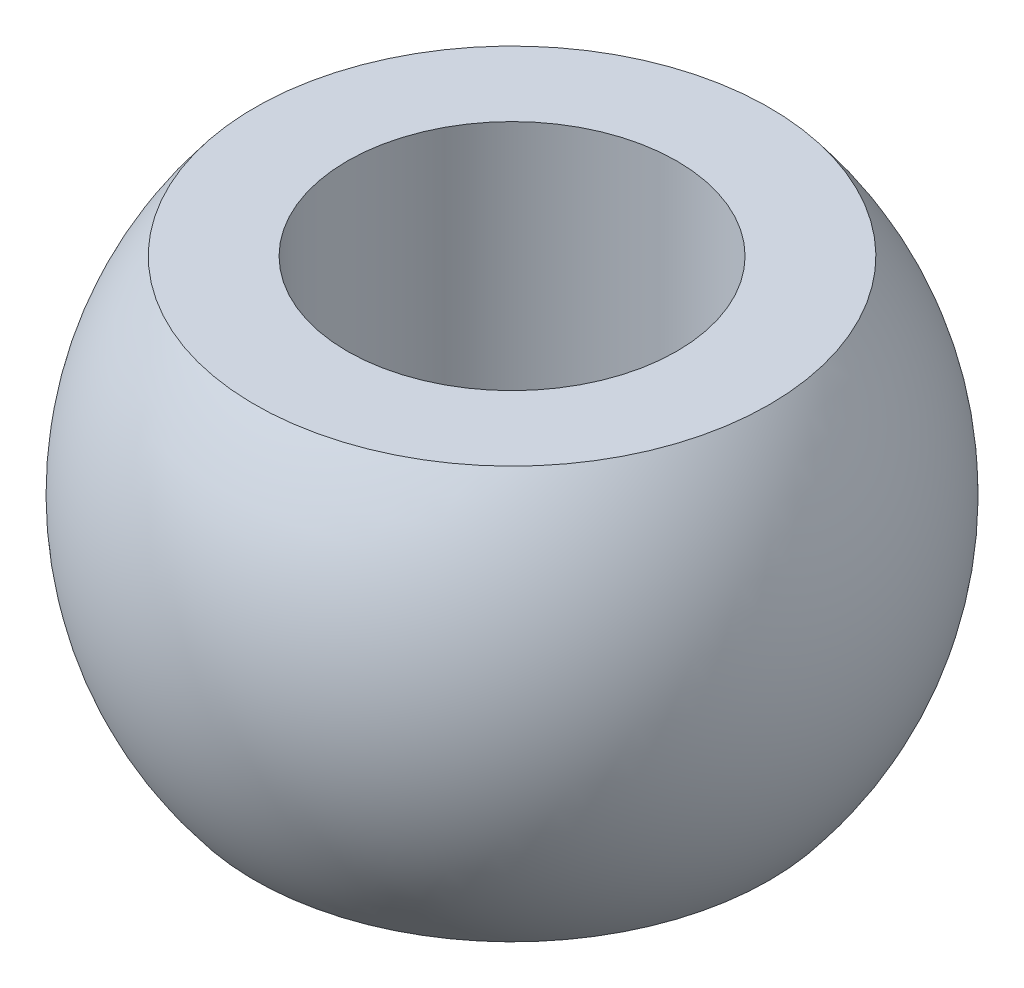
ISO-10303-21;
HEADER;
FILE_DESCRIPTION(('STEP AP214'),'2;1');
FILE_NAME('part.step','',(''),(''),'','','');
FILE_SCHEMA(('AUTOMOTIVE_DESIGN { 1 0 10303 214 1 1 1 1 }'));
ENDSEC;
DATA;
#1=APPLICATION_CONTEXT('core data for automotive mechanical design processes');
#2=APPLICATION_PROTOCOL_DEFINITION('international standard','automotive_design',2000,#1);
#3=PRODUCT_CONTEXT('',#1,'mechanical');
#4=PRODUCT('Part','Part','',(#3));
#5=PRODUCT_RELATED_PRODUCT_CATEGORY('part','',(#4));
#6=PRODUCT_DEFINITION_FORMATION('','',#4);
#7=PRODUCT_DEFINITION_CONTEXT('part definition',#1,'design');
#8=PRODUCT_DEFINITION('design','',#6,#7);
#9=PRODUCT_DEFINITION_SHAPE('','',#8);
#10=(LENGTH_UNIT() NAMED_UNIT(*) SI_UNIT(.MILLI.,.METRE.));
#11=(NAMED_UNIT(*) PLANE_ANGLE_UNIT() SI_UNIT($,.RADIAN.));
#12=(NAMED_UNIT(*) SI_UNIT($,.STERADIAN.) SOLID_ANGLE_UNIT());
#13=UNCERTAINTY_MEASURE_WITH_UNIT(LENGTH_MEASURE(1.E-05),#10,'distance_accuracy_value','');
#14=(GEOMETRIC_REPRESENTATION_CONTEXT(3) GLOBAL_UNCERTAINTY_ASSIGNED_CONTEXT((#13)) GLOBAL_UNIT_ASSIGNED_CONTEXT((#10,
#11,#12)) REPRESENTATION_CONTEXT('',''));
#15=CARTESIAN_POINT('',(0.,0.,0.));
#16=DIRECTION('',(0.,0.,1.));
#17=DIRECTION('',(1.,0.,0.));
#18=AXIS2_PLACEMENT_3D('',#15,#16,#17);
#19=CARTESIAN_POINT('',(0.,0.,0.));
#20=DIRECTION('',(0.,1.,0.));
#21=DIRECTION('',(1.,0.,0.));
#22=AXIS2_PLACEMENT_3D('',#19,#20,#21);
#23=SPHERICAL_SURFACE('',#22,8.);
#24=CARTESIAN_POINT('',(0.,5.,0.));
#25=DIRECTION('',(0.,-1.,0.));
#26=DIRECTION('',(0.,0.,-1.));
#27=AXIS2_PLACEMENT_3D('',#24,#25,#26);
#28=CIRCLE('',#27,6.2449979983984);
#29=CARTESIAN_POINT('',(6.2449979983984,5.,0.));
#30=VERTEX_POINT('',#29);
#31=EDGE_CURVE('E11',#30,#30,#28,.F.);
#32=CARTESIAN_POINT('',(0.,-5.,0.));
#33=DIRECTION('',(0.,1.,0.));
#34=DIRECTION('',(0.,0.,1.));
#35=AXIS2_PLACEMENT_3D('',#32,#33,#34);
#36=CIRCLE('',#35,6.2449979983984);
#37=CARTESIAN_POINT('',(6.2449979983984,-5.,0.));
#38=VERTEX_POINT('',#37);
#39=EDGE_CURVE('E45',#38,#38,#36,.F.);
#40=CARTESIAN_POINT('',(6.2449979983984,5.,0.));
#41=CARTESIAN_POINT('',(6.31532542239523,4.91216350208699,0.));
#42=CARTESIAN_POINT('',(6.38379727042982,4.82284149647974,0.));
#43=CARTESIAN_POINT('',(6.51691329407893,4.64138942477172,0.));
#44=CARTESIAN_POINT('',(6.58155746969343,4.54925935867094,0.));
#45=CARTESIAN_POINT('',(6.70690162800672,4.36235412087081,0.));
#46=CARTESIAN_POINT('',(6.76760161070551,4.26757894917145,0.));
#47=CARTESIAN_POINT('',(6.8849497100288,4.07555250338974,0.));
#48=CARTESIAN_POINT('',(6.94159782665332,3.97830122930739,0.));
#49=CARTESIAN_POINT('',(7.0507412446322,3.78149563106059,0.));
#50=CARTESIAN_POINT('',(7.10323654598657,3.68194130689616,0.));
#51=CARTESIAN_POINT('',(7.20398090822055,3.48070685687896,0.));
#52=CARTESIAN_POINT('',(7.25222996910015,3.37902673102621,0.));
#53=CARTESIAN_POINT('',(7.34439594927461,3.17372168464108,0.));
#54=CARTESIAN_POINT('',(7.38831286856946,3.0700967641087,0.));
#55=CARTESIAN_POINT('',(7.47173638601826,2.86108660442972,0.));
#56=CARTESIAN_POINT('',(7.51124298417222,2.75570136528313,0.));
#57=CARTESIAN_POINT('',(7.58577552857971,2.54335817633609,0.));
#58=CARTESIAN_POINT('',(7.62080147483325,2.43640022653565,0.));
#59=CARTESIAN_POINT('',(7.68631036187851,2.22110202449965,0.));
#60=CARTESIAN_POINT('',(7.71679330267022,2.11276177226408,0.));
#61=CARTESIAN_POINT('',(7.77316191257441,1.89489183423884,0.));
#62=CARTESIAN_POINT('',(7.79904758168689,1.78536214844915,0.));
#63=CARTESIAN_POINT('',(7.84617556619433,1.56530832967935,0.));
#64=CARTESIAN_POINT('',(7.86741788158929,1.45478419669923,0.));
#65=CARTESIAN_POINT('',(7.90522134277692,1.2329382402322,0.));
#66=CARTESIAN_POINT('',(7.9217824885696,1.12161641674528,0.));
#67=CARTESIAN_POINT('',(7.9501941281583,0.898373256011238,0.));
#68=CARTESIAN_POINT('',(7.96204462195432,0.786451918764102,0.));
#69=CARTESIAN_POINT('',(7.98101386112632,0.562208974518694,0.));
#70=CARTESIAN_POINT('',(7.9881326065023,0.44988736752042,0.));
#71=CARTESIAN_POINT('',(7.99762567593914,0.225043840348098,0.));
#72=CARTESIAN_POINT('',(8.,0.112521920174049,0.));
#73=CARTESIAN_POINT('',(8.,-0.112521920174049,0.));
#74=CARTESIAN_POINT('',(7.99762567593914,-0.225043840348098,0.));
#75=CARTESIAN_POINT('',(7.9881326065023,-0.44988736752042,0.));
#76=CARTESIAN_POINT('',(7.98101386112632,-0.562208974518694,0.));
#77=CARTESIAN_POINT('',(7.96204462195432,-0.786451918764102,0.));
#78=CARTESIAN_POINT('',(7.9501941281583,-0.898373256011238,0.));
#79=CARTESIAN_POINT('',(7.9217824885696,-1.12161641674528,0.));
#80=CARTESIAN_POINT('',(7.90522134277692,-1.2329382402322,0.));
#81=CARTESIAN_POINT('',(7.86741788158929,-1.45478419669923,0.));
#82=CARTESIAN_POINT('',(7.84617556619433,-1.56530832967935,0.));
#83=CARTESIAN_POINT('',(7.79904758168689,-1.78536214844915,0.));
#84=CARTESIAN_POINT('',(7.77316191257441,-1.89489183423884,0.));
#85=CARTESIAN_POINT('',(7.71679330267022,-2.11276177226408,0.));
#86=CARTESIAN_POINT('',(7.68631036187851,-2.22110202449965,0.));
#87=CARTESIAN_POINT('',(7.62080147483325,-2.43640022653565,0.));
#88=CARTESIAN_POINT('',(7.58577552857971,-2.54335817633609,0.));
#89=CARTESIAN_POINT('',(7.51124298417222,-2.75570136528313,0.));
#90=CARTESIAN_POINT('',(7.47173638601827,-2.86108660442972,0.));
#91=CARTESIAN_POINT('',(7.38831286856946,-3.0700967641087,0.));
#92=CARTESIAN_POINT('',(7.34439594927461,-3.17372168464108,0.));
#93=CARTESIAN_POINT('',(7.25222996910015,-3.37902673102621,0.));
#94=CARTESIAN_POINT('',(7.20398090822055,-3.48070685687897,0.));
#95=CARTESIAN_POINT('',(7.10323654598657,-3.68194130689616,0.));
#96=CARTESIAN_POINT('',(7.0507412446322,-3.78149563106059,0.));
#97=CARTESIAN_POINT('',(6.94159782665332,-3.97830122930739,0.));
#98=CARTESIAN_POINT('',(6.8849497100288,-4.07555250338974,0.));
#99=CARTESIAN_POINT('',(6.76760161070551,-4.26757894917145,0.));
#100=CARTESIAN_POINT('',(6.70690162800672,-4.36235412087081,0.));
#101=CARTESIAN_POINT('',(6.58155746969343,-4.54925935867094,0.));
#102=CARTESIAN_POINT('',(6.51691329407893,-4.64138942477172,0.));
#103=CARTESIAN_POINT('',(6.38379727042982,-4.82284149647975,0.));
#104=CARTESIAN_POINT('',(6.31532542239523,-4.91216350208699,0.));
#105=CARTESIAN_POINT('',(6.2449979983984,-5.,0.));
#106=B_SPLINE_CURVE_WITH_KNOTS('',3,(#40,#41,#42,#43,#44,#45,#46,#47,#48,#49,#50,#51,#52,#53,
#54,#55,#56,#57,#58,#59,#60,#61,#62,#63,#64,#65,#66,#67,#68,#69,#70,#71,#72,#73,#74,#75,#76,#77,
#78,#79,#80,#81,#82,#83,#84,#85,#86,#87,#88,#89,#90,#91,#92,#93,#94,#95,#96,#97,#98,#99,#100,
#101,#102,#103,#104,#105),.UNSPECIFIED.,.F.,.F.,(4,2,2,2,2,2,2,2,2,2,2,2,2,2,2,2,2,2,2,2,2,2,2,
2,2,2,2,2,2,2,2,2,4),(0.,0.33754072416298,0.67508144832596,1.01262217248894,1.35016289665192,
1.6877036208149,2.02524434497788,2.36278506914086,2.70032579330384,3.03786651746681,
3.37540724162979,3.71294796579277,4.05048868995575,4.38802941411873,4.72557013828171,
5.06311086244469,5.40065158660767,5.73819231077065,6.07573303493363,6.41327375909661,
6.75081448325959,7.08835520742257,7.42589593158555,7.76343665574853,8.10097737991151,
8.43851810407449,8.77605882823747,9.11359955240045,9.45114027656343,9.7886810007264,
10.1262217248894,10.4637624490524,10.8013031732153),.UNSPECIFIED.);
#107=EDGE_CURVE('BSEAM39',#30,#38,#106,.T.);
#108=ORIENTED_EDGE('',*,*,#31,.F.);
#109=ORIENTED_EDGE('',*,*,#39,.F.);
#110=ORIENTED_EDGE('',*,*,#107,.T.);
#111=ORIENTED_EDGE('',*,*,#107,.F.);
#112=EDGE_LOOP('',(#108,#110,#109,#111));
#113=FACE_BOUND('',#112,.T.);
#114=ADVANCED_FACE('F39',(#113),#23,.T.);
#115=CARTESIAN_POINT('',(-11.8354956902816,-5.,8.));
#116=DIRECTION('',(0.,1.,0.));
#117=DIRECTION('',(0.,0.,1.));
#118=AXIS2_PLACEMENT_3D('',#115,#116,#117);
#119=PLANE('',#118);
#120=CARTESIAN_POINT('',(0.,-5.,0.));
#121=DIRECTION('',(0.,1.,0.));
#122=DIRECTION('',(0.,0.,1.));
#123=AXIS2_PLACEMENT_3D('',#120,#121,#122);
#124=CIRCLE('',#123,4.);
#125=CARTESIAN_POINT('',(0.,-5.,4.));
#126=VERTEX_POINT('',#125);
#127=EDGE_CURVE('E49',#126,#126,#124,.F.);
#128=ORIENTED_EDGE('',*,*,#127,.F.);
#129=EDGE_LOOP('',(#128));
#130=FACE_BOUND('',#129,.T.);
#131=ORIENTED_EDGE('',*,*,#39,.T.);
#132=EDGE_LOOP('',(#131));
#133=FACE_BOUND('',#132,.T.);
#134=ADVANCED_FACE('F64',(#130,#133),#119,.F.);
#135=CARTESIAN_POINT('',(-11.8354956902816,5.,8.));
#136=DIRECTION('',(0.,-1.,0.));
#137=DIRECTION('',(0.,0.,-1.));
#138=AXIS2_PLACEMENT_3D('',#135,#136,#137);
#139=PLANE('',#138);
#140=CARTESIAN_POINT('',(0.,5.,0.));
#141=DIRECTION('',(0.,1.,0.));
#142=DIRECTION('',(0.,0.,1.));
#143=AXIS2_PLACEMENT_3D('',#140,#141,#142);
#144=CIRCLE('',#143,4.);
#145=CARTESIAN_POINT('',(0.,5.,4.));
#146=VERTEX_POINT('',#145);
#147=EDGE_CURVE('E53',#146,#146,#144,.T.);
#148=ORIENTED_EDGE('',*,*,#147,.F.);
#149=EDGE_LOOP('',(#148));
#150=FACE_BOUND('',#149,.T.);
#151=ORIENTED_EDGE('',*,*,#31,.T.);
#152=EDGE_LOOP('',(#151));
#153=FACE_BOUND('',#152,.T.);
#154=ADVANCED_FACE('F62',(#150,#153),#139,.F.);
#155=CARTESIAN_POINT('',(0.,-5.001,0.));
#156=DIRECTION('',(0.,1.,0.));
#157=DIRECTION('',(0.,0.,1.));
#158=AXIS2_PLACEMENT_3D('',#155,#156,#157);
#159=CYLINDRICAL_SURFACE('',#158,4.);
#160=ORIENTED_EDGE('',*,*,#147,.T.);
#161=EDGE_LOOP('',(#160));
#162=FACE_BOUND('',#161,.T.);
#163=ORIENTED_EDGE('',*,*,#127,.T.);
#164=EDGE_LOOP('',(#163));
#165=FACE_BOUND('',#164,.T.);
#166=ADVANCED_FACE('F59',(#162,#165),#159,.F.);
#167=CLOSED_SHELL('',(#114,#134,#154,#166));
#168=MANIFOLD_SOLID_BREP('B2',#167);
#169=ADVANCED_BREP_SHAPE_REPRESENTATION('',(#18,#168),#14);
#170=SHAPE_DEFINITION_REPRESENTATION(#9,#169);
ENDSEC;
END-ISO-10303-21;
